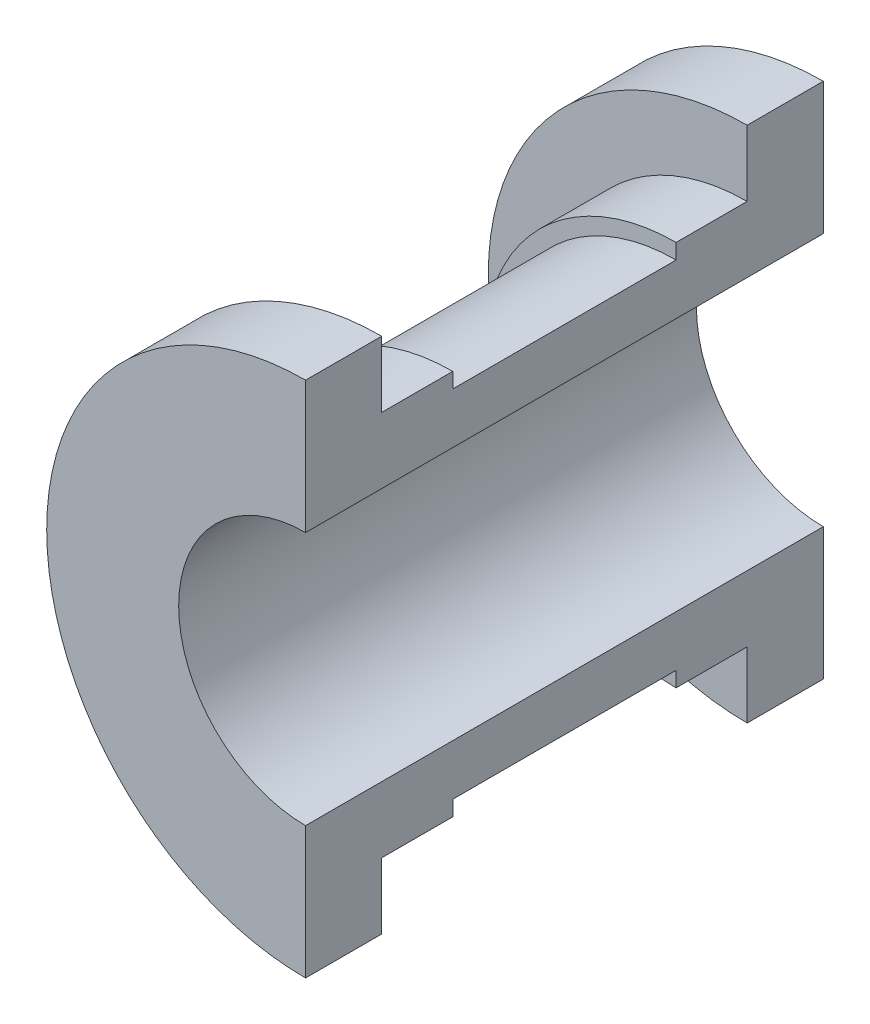
ISO-10303-21;
HEADER;
FILE_DESCRIPTION(('STEP AP214'),'2;1');
FILE_NAME('part.step','',(''),(''),'','','');
FILE_SCHEMA(('AUTOMOTIVE_DESIGN { 1 0 10303 214 1 1 1 1 }'));
ENDSEC;
DATA;
#1=APPLICATION_CONTEXT('core data for automotive mechanical design processes');
#2=APPLICATION_PROTOCOL_DEFINITION('international standard','automotive_design',2000,#1);
#3=PRODUCT_CONTEXT('',#1,'mechanical');
#4=PRODUCT('Part','Part','',(#3));
#5=PRODUCT_RELATED_PRODUCT_CATEGORY('part','',(#4));
#6=PRODUCT_DEFINITION_FORMATION('','',#4);
#7=PRODUCT_DEFINITION_CONTEXT('part definition',#1,'design');
#8=PRODUCT_DEFINITION('design','',#6,#7);
#9=PRODUCT_DEFINITION_SHAPE('','',#8);
#10=(LENGTH_UNIT() NAMED_UNIT(*) SI_UNIT(.MILLI.,.METRE.));
#11=(NAMED_UNIT(*) PLANE_ANGLE_UNIT() SI_UNIT($,.RADIAN.));
#12=(NAMED_UNIT(*) SI_UNIT($,.STERADIAN.) SOLID_ANGLE_UNIT());
#13=UNCERTAINTY_MEASURE_WITH_UNIT(LENGTH_MEASURE(1.E-05),#10,'distance_accuracy_value','');
#14=(GEOMETRIC_REPRESENTATION_CONTEXT(3) GLOBAL_UNCERTAINTY_ASSIGNED_CONTEXT((#13)) GLOBAL_UNIT_ASSIGNED_CONTEXT((#10,
#11,#12)) REPRESENTATION_CONTEXT('',''));
#15=CARTESIAN_POINT('',(0.,0.,0.));
#16=DIRECTION('',(0.,0.,1.));
#17=DIRECTION('',(1.,0.,0.));
#18=AXIS2_PLACEMENT_3D('',#15,#16,#17);
#19=CARTESIAN_POINT('',(-23.5,0.,25.5));
#20=DIRECTION('',(1.,0.,0.));
#21=DIRECTION('',(0.,0.,-1.));
#22=AXIS2_PLACEMENT_3D('',#19,#20,#21);
#23=CYLINDRICAL_SURFACE('',#22,3.);
#24=CARTESIAN_POINT('',(-23.5,0.,25.5));
#25=DIRECTION('',(1.,0.,0.));
#26=DIRECTION('',(0.,0.,-1.));
#27=AXIS2_PLACEMENT_3D('',#24,#25,#26);
#28=CIRCLE('',#27,3.);
#29=CARTESIAN_POINT('',(-23.5,0.,22.5));
#30=VERTEX_POINT('',#29);
#31=EDGE_CURVE('E11',#30,#30,#28,.T.);
#32=ORIENTED_EDGE('',*,*,#31,.T.);
#33=EDGE_LOOP('',(#32));
#34=FACE_BOUND('',#33,.T.);
#35=CARTESIAN_POINT('',(-17.5,0.,25.5));
#36=DIRECTION('',(1.,0.,0.));
#37=DIRECTION('',(0.,0.,-1.));
#38=AXIS2_PLACEMENT_3D('',#35,#36,#37);
#39=CIRCLE('',#38,3.);
#40=CARTESIAN_POINT('',(-17.5,0.,22.5));
#41=VERTEX_POINT('',#40);
#42=EDGE_CURVE('E44',#41,#41,#39,.T.);
#43=ORIENTED_EDGE('',*,*,#42,.F.);
#44=EDGE_LOOP('',(#43));
#45=FACE_BOUND('',#44,.T.);
#46=ADVANCED_FACE('F41',(#34,#45),#23,.T.);
#47=CARTESIAN_POINT('',(-23.5,0.,25.5));
#48=DIRECTION('',(1.,0.,0.));
#49=DIRECTION('',(0.,0.,-1.));
#50=AXIS2_PLACEMENT_3D('',#47,#48,#49);
#51=PLANE('',#50);
#52=ORIENTED_EDGE('',*,*,#31,.F.);
#53=EDGE_LOOP('',(#52));
#54=FACE_BOUND('',#53,.T.);
#55=ADVANCED_FACE('F56',(#54),#51,.F.);
#56=CARTESIAN_POINT('',(-17.5,0.,25.5));
#57=DIRECTION('',(1.,0.,0.));
#58=DIRECTION('',(0.,0.,-1.));
#59=AXIS2_PLACEMENT_3D('',#56,#57,#58);
#60=PLANE('',#59);
#61=ORIENTED_EDGE('',*,*,#42,.T.);
#62=EDGE_LOOP('',(#61));
#63=FACE_BOUND('',#62,.T.);
#64=ADVANCED_FACE('F53',(#63),#60,.T.);
#65=CLOSED_SHELL('',(#46,#55,#64));
#66=MANIFOLD_SOLID_BREP('B2',#65);
#67=CARTESIAN_POINT('',(0.,-25.5,0.));
#68=DIRECTION('',(0.,0.,-1.));
#69=DIRECTION('',(-1.,0.,0.));
#70=AXIS2_PLACEMENT_3D('',#67,#68,#69);
#71=PLANE('',#70);
#72=CARTESIAN_POINT('',(0.,0.,0.));
#73=DIRECTION('',(0.,0.,-1.));
#74=DIRECTION('',(-1.,0.,0.));
#75=AXIS2_PLACEMENT_3D('',#72,#73,#74);
#76=CIRCLE('',#75,12.5);
#77=CARTESIAN_POINT('',(0.,-12.5,0.));
#78=VERTEX_POINT('',#77);
#79=CARTESIAN_POINT('',(0.,12.5,0.));
#80=VERTEX_POINT('',#79);
#81=EDGE_CURVE('E39',#78,#80,#76,.T.);
#82=ORIENTED_EDGE('',*,*,#81,.F.);
#83=DIRECTION('',(0.,-1.,0.));
#84=VECTOR('',#83,1.);
#85=CARTESIAN_POINT('',(0.,-25.5,0.));
#86=LINE('',#85,#84);
#87=CARTESIAN_POINT('',(0.,-25.5,0.));
#88=VERTEX_POINT('',#87);
#89=EDGE_CURVE('E171',#78,#88,#86,.T.);
#90=ORIENTED_EDGE('',*,*,#89,.T.);
#91=CARTESIAN_POINT('',(0.,0.,0.));
#92=DIRECTION('',(0.,0.,-1.));
#93=DIRECTION('',(-1.,0.,0.));
#94=AXIS2_PLACEMENT_3D('',#91,#92,#93);
#95=CIRCLE('',#94,25.5);
#96=CARTESIAN_POINT('',(0.,25.5,0.));
#97=VERTEX_POINT('',#96);
#98=EDGE_CURVE('E166',#88,#97,#95,.T.);
#99=ORIENTED_EDGE('',*,*,#98,.T.);
#100=DIRECTION('',(0.,1.,0.));
#101=VECTOR('',#100,1.);
#102=CARTESIAN_POINT('',(0.,25.5,0.));
#103=LINE('',#102,#101);
#104=EDGE_CURVE('E169',#80,#97,#103,.T.);
#105=ORIENTED_EDGE('',*,*,#104,.F.);
#106=EDGE_LOOP('',(#82,#90,#99,#105));
#107=FACE_BOUND('',#106,.T.);
#108=ADVANCED_FACE('F82',(#107),#71,.T.);
#109=CARTESIAN_POINT('',(0.,0.,-45.6568957060864));
#110=DIRECTION('',(0.,0.,-1.));
#111=DIRECTION('',(-1.,0.,0.));
#112=AXIS2_PLACEMENT_3D('',#109,#110,#111);
#113=CYLINDRICAL_SURFACE('',#112,12.5);
#114=CARTESIAN_POINT('',(0.,0.,51.));
#115=DIRECTION('',(0.,0.,-1.));
#116=DIRECTION('',(-1.,0.,0.));
#117=AXIS2_PLACEMENT_3D('',#114,#115,#116);
#118=CIRCLE('',#117,12.5);
#119=CARTESIAN_POINT('',(0.,-12.5,51.));
#120=VERTEX_POINT('',#119);
#121=CARTESIAN_POINT('',(0.,12.5,51.));
#122=VERTEX_POINT('',#121);
#123=EDGE_CURVE('E90',#120,#122,#118,.T.);
#124=ORIENTED_EDGE('',*,*,#123,.F.);
#125=DIRECTION('',(0.,0.,-1.));
#126=VECTOR('',#125,1.);
#127=CARTESIAN_POINT('',(0.,-12.5,0.));
#128=LINE('',#127,#126);
#129=EDGE_CURVE('E176',#120,#78,#128,.T.);
#130=ORIENTED_EDGE('',*,*,#129,.T.);
#131=ORIENTED_EDGE('',*,*,#81,.T.);
#132=DIRECTION('',(0.,0.,-1.));
#133=VECTOR('',#132,1.);
#134=CARTESIAN_POINT('',(0.,12.5,0.));
#135=LINE('',#134,#133);
#136=EDGE_CURVE('E189',#122,#80,#135,.T.);
#137=ORIENTED_EDGE('',*,*,#136,.F.);
#138=EDGE_LOOP('',(#124,#130,#131,#137));
#139=FACE_BOUND('',#138,.T.);
#140=ADVANCED_FACE('F84',(#139),#113,.F.);
#141=CARTESIAN_POINT('',(0.,-12.5,51.));
#142=DIRECTION('',(0.,0.,1.));
#143=DIRECTION('',(1.,0.,0.));
#144=AXIS2_PLACEMENT_3D('',#141,#142,#143);
#145=PLANE('',#144);
#146=CARTESIAN_POINT('',(0.,0.,51.));
#147=DIRECTION('',(0.,0.,-1.));
#148=DIRECTION('',(-1.,0.,0.));
#149=AXIS2_PLACEMENT_3D('',#146,#147,#148);
#150=CIRCLE('',#149,25.5);
#151=CARTESIAN_POINT('',(0.,-25.5,51.));
#152=VERTEX_POINT('',#151);
#153=CARTESIAN_POINT('',(0.,25.5,51.));
#154=VERTEX_POINT('',#153);
#155=EDGE_CURVE('E262',#152,#154,#150,.T.);
#156=ORIENTED_EDGE('',*,*,#155,.F.);
#157=DIRECTION('',(0.,1.,0.));
#158=VECTOR('',#157,1.);
#159=CARTESIAN_POINT('',(0.,-12.5,51.));
#160=LINE('',#159,#158);
#161=EDGE_CURVE('E244',#152,#120,#160,.T.);
#162=ORIENTED_EDGE('',*,*,#161,.T.);
#163=ORIENTED_EDGE('',*,*,#123,.T.);
#164=DIRECTION('',(0.,-1.,0.));
#165=VECTOR('',#164,1.);
#166=CARTESIAN_POINT('',(0.,12.5,51.));
#167=LINE('',#166,#165);
#168=EDGE_CURVE('E214',#154,#122,#167,.T.);
#169=ORIENTED_EDGE('',*,*,#168,.F.);
#170=EDGE_LOOP('',(#156,#162,#163,#169));
#171=FACE_BOUND('',#170,.T.);
#172=ADVANCED_FACE('F265',(#171),#145,.T.);
#173=CARTESIAN_POINT('',(0.,0.,-45.6568957060864));
#174=DIRECTION('',(0.,0.,-1.));
#175=DIRECTION('',(-1.,0.,0.));
#176=AXIS2_PLACEMENT_3D('',#173,#174,#175);
#177=CYLINDRICAL_SURFACE('',#176,25.5);
#178=CARTESIAN_POINT('',(0.,0.,43.5));
#179=DIRECTION('',(0.,0.,-1.));
#180=DIRECTION('',(-1.,0.,0.));
#181=AXIS2_PLACEMENT_3D('',#178,#179,#180);
#182=CIRCLE('',#181,25.5);
#183=CARTESIAN_POINT('',(0.,-25.5,43.5));
#184=VERTEX_POINT('',#183);
#185=CARTESIAN_POINT('',(0.,25.5,43.5));
#186=VERTEX_POINT('',#185);
#187=EDGE_CURVE('E260',#184,#186,#182,.T.);
#188=ORIENTED_EDGE('',*,*,#187,.F.);
#189=DIRECTION('',(0.,0.,1.));
#190=VECTOR('',#189,1.);
#191=CARTESIAN_POINT('',(0.,-25.5,51.));
#192=LINE('',#191,#190);
#193=EDGE_CURVE('E241',#184,#152,#192,.T.);
#194=ORIENTED_EDGE('',*,*,#193,.T.);
#195=ORIENTED_EDGE('',*,*,#155,.T.);
#196=DIRECTION('',(0.,0.,1.));
#197=VECTOR('',#196,1.);
#198=CARTESIAN_POINT('',(0.,25.5,51.));
#199=LINE('',#198,#197);
#200=EDGE_CURVE('E211',#186,#154,#199,.T.);
#201=ORIENTED_EDGE('',*,*,#200,.F.);
#202=EDGE_LOOP('',(#188,#194,#195,#201));
#203=FACE_BOUND('',#202,.T.);
#204=ADVANCED_FACE('F300',(#203),#177,.T.);
#205=CARTESIAN_POINT('',(0.,-25.5,43.5));
#206=DIRECTION('',(0.,0.,-1.));
#207=DIRECTION('',(-1.,0.,0.));
#208=AXIS2_PLACEMENT_3D('',#205,#206,#207);
#209=PLANE('',#208);
#210=CARTESIAN_POINT('',(0.,0.,43.5));
#211=DIRECTION('',(0.,0.,-1.));
#212=DIRECTION('',(-1.,0.,0.));
#213=AXIS2_PLACEMENT_3D('',#210,#211,#212);
#214=CIRCLE('',#213,19.);
#215=CARTESIAN_POINT('',(0.,-19.,43.5));
#216=VERTEX_POINT('',#215);
#217=CARTESIAN_POINT('',(0.,19.,43.5));
#218=VERTEX_POINT('',#217);
#219=EDGE_CURVE('E258',#216,#218,#214,.T.);
#220=ORIENTED_EDGE('',*,*,#219,.F.);
#221=DIRECTION('',(0.,-1.,0.));
#222=VECTOR('',#221,1.);
#223=CARTESIAN_POINT('',(0.,-25.5,43.5));
#224=LINE('',#223,#222);
#225=EDGE_CURVE('E238',#216,#184,#224,.T.);
#226=ORIENTED_EDGE('',*,*,#225,.T.);
#227=ORIENTED_EDGE('',*,*,#187,.T.);
#228=DIRECTION('',(0.,1.,0.));
#229=VECTOR('',#228,1.);
#230=CARTESIAN_POINT('',(0.,25.5,43.5));
#231=LINE('',#230,#229);
#232=EDGE_CURVE('E208',#218,#186,#231,.T.);
#233=ORIENTED_EDGE('',*,*,#232,.F.);
#234=EDGE_LOOP('',(#220,#226,#227,#233));
#235=FACE_BOUND('',#234,.T.);
#236=ADVANCED_FACE('F297',(#235),#209,.T.);
#237=CARTESIAN_POINT('',(0.,0.,-45.6568957060864));
#238=DIRECTION('',(0.,0.,-1.));
#239=DIRECTION('',(-1.,0.,0.));
#240=AXIS2_PLACEMENT_3D('',#237,#238,#239);
#241=CYLINDRICAL_SURFACE('',#240,19.);
#242=CARTESIAN_POINT('',(0.,0.,36.5));
#243=DIRECTION('',(0.,0.,-1.));
#244=DIRECTION('',(-1.,0.,0.));
#245=AXIS2_PLACEMENT_3D('',#242,#243,#244);
#246=CIRCLE('',#245,19.);
#247=CARTESIAN_POINT('',(0.,-19.,36.5));
#248=VERTEX_POINT('',#247);
#249=CARTESIAN_POINT('',(0.,19.,36.5));
#250=VERTEX_POINT('',#249);
#251=EDGE_CURVE('E256',#248,#250,#246,.T.);
#252=ORIENTED_EDGE('',*,*,#251,.F.);
#253=DIRECTION('',(0.,0.,1.));
#254=VECTOR('',#253,1.);
#255=CARTESIAN_POINT('',(0.,-19.,43.5));
#256=LINE('',#255,#254);
#257=EDGE_CURVE('E235',#248,#216,#256,.T.);
#258=ORIENTED_EDGE('',*,*,#257,.T.);
#259=ORIENTED_EDGE('',*,*,#219,.T.);
#260=DIRECTION('',(0.,0.,1.));
#261=VECTOR('',#260,1.);
#262=CARTESIAN_POINT('',(0.,19.,43.5));
#263=LINE('',#262,#261);
#264=EDGE_CURVE('E205',#250,#218,#263,.T.);
#265=ORIENTED_EDGE('',*,*,#264,.F.);
#266=EDGE_LOOP('',(#252,#258,#259,#265));
#267=FACE_BOUND('',#266,.T.);
#268=ADVANCED_FACE('F294',(#267),#241,.T.);
#269=CARTESIAN_POINT('',(0.,-19.,36.5));
#270=DIRECTION('',(0.,0.,-1.));
#271=DIRECTION('',(-1.,0.,0.));
#272=AXIS2_PLACEMENT_3D('',#269,#270,#271);
#273=PLANE('',#272);
#274=CARTESIAN_POINT('',(0.,0.,36.5));
#275=DIRECTION('',(0.,0.,-1.));
#276=DIRECTION('',(-1.,0.,0.));
#277=AXIS2_PLACEMENT_3D('',#274,#275,#276);
#278=CIRCLE('',#277,17.5);
#279=CARTESIAN_POINT('',(0.,-17.5,36.5));
#280=VERTEX_POINT('',#279);
#281=CARTESIAN_POINT('',(0.,17.5,36.5));
#282=VERTEX_POINT('',#281);
#283=EDGE_CURVE('E254',#280,#282,#278,.T.);
#284=ORIENTED_EDGE('',*,*,#283,.F.);
#285=DIRECTION('',(0.,-1.,0.));
#286=VECTOR('',#285,1.);
#287=CARTESIAN_POINT('',(0.,-19.,36.5));
#288=LINE('',#287,#286);
#289=EDGE_CURVE('E232',#280,#248,#288,.T.);
#290=ORIENTED_EDGE('',*,*,#289,.T.);
#291=ORIENTED_EDGE('',*,*,#251,.T.);
#292=DIRECTION('',(0.,1.,0.));
#293=VECTOR('',#292,1.);
#294=CARTESIAN_POINT('',(0.,19.,36.5));
#295=LINE('',#294,#293);
#296=EDGE_CURVE('E202',#282,#250,#295,.T.);
#297=ORIENTED_EDGE('',*,*,#296,.F.);
#298=EDGE_LOOP('',(#284,#290,#291,#297));
#299=FACE_BOUND('',#298,.T.);
#300=ADVANCED_FACE('F289',(#299),#273,.T.);
#301=CARTESIAN_POINT('',(0.,0.,-45.6568957060864));
#302=DIRECTION('',(0.,0.,-1.));
#303=DIRECTION('',(-1.,0.,0.));
#304=AXIS2_PLACEMENT_3D('',#301,#302,#303);
#305=CYLINDRICAL_SURFACE('',#304,17.5);
#306=CARTESIAN_POINT('',(0.,0.,14.5));
#307=DIRECTION('',(0.,0.,-1.));
#308=DIRECTION('',(-1.,0.,0.));
#309=AXIS2_PLACEMENT_3D('',#306,#307,#308);
#310=CIRCLE('',#309,17.5);
#311=CARTESIAN_POINT('',(0.,-17.5,14.5));
#312=VERTEX_POINT('',#311);
#313=CARTESIAN_POINT('',(0.,17.5,14.5));
#314=VERTEX_POINT('',#313);
#315=EDGE_CURVE('E252',#312,#314,#310,.T.);
#316=ORIENTED_EDGE('',*,*,#315,.F.);
#317=DIRECTION('',(0.,0.,1.));
#318=VECTOR('',#317,1.);
#319=CARTESIAN_POINT('',(0.,-17.5,36.5));
#320=LINE('',#319,#318);
#321=EDGE_CURVE('E229',#312,#280,#320,.T.);
#322=ORIENTED_EDGE('',*,*,#321,.T.);
#323=ORIENTED_EDGE('',*,*,#283,.T.);
#324=DIRECTION('',(0.,0.,1.));
#325=VECTOR('',#324,1.);
#326=CARTESIAN_POINT('',(0.,17.5,36.5));
#327=LINE('',#326,#325);
#328=EDGE_CURVE('E199',#314,#282,#327,.T.);
#329=ORIENTED_EDGE('',*,*,#328,.F.);
#330=EDGE_LOOP('',(#316,#322,#323,#329));
#331=FACE_BOUND('',#330,.T.);
#332=ADVANCED_FACE('F286',(#331),#305,.T.);
#333=CARTESIAN_POINT('',(0.,-17.5,14.5));
#334=DIRECTION('',(0.,0.,1.));
#335=DIRECTION('',(1.,0.,0.));
#336=AXIS2_PLACEMENT_3D('',#333,#334,#335);
#337=PLANE('',#336);
#338=CARTESIAN_POINT('',(0.,0.,14.5));
#339=DIRECTION('',(0.,0.,-1.));
#340=DIRECTION('',(-1.,0.,0.));
#341=AXIS2_PLACEMENT_3D('',#338,#339,#340);
#342=CIRCLE('',#341,19.);
#343=CARTESIAN_POINT('',(0.,-19.,14.5));
#344=VERTEX_POINT('',#343);
#345=CARTESIAN_POINT('',(0.,19.,14.5));
#346=VERTEX_POINT('',#345);
#347=EDGE_CURVE('E250',#344,#346,#342,.T.);
#348=ORIENTED_EDGE('',*,*,#347,.F.);
#349=DIRECTION('',(0.,1.,0.));
#350=VECTOR('',#349,1.);
#351=CARTESIAN_POINT('',(0.,-17.5,14.5));
#352=LINE('',#351,#350);
#353=EDGE_CURVE('E226',#344,#312,#352,.T.);
#354=ORIENTED_EDGE('',*,*,#353,.T.);
#355=ORIENTED_EDGE('',*,*,#315,.T.);
#356=DIRECTION('',(0.,-1.,0.));
#357=VECTOR('',#356,1.);
#358=CARTESIAN_POINT('',(0.,17.5,14.5));
#359=LINE('',#358,#357);
#360=EDGE_CURVE('E196',#346,#314,#359,.T.);
#361=ORIENTED_EDGE('',*,*,#360,.F.);
#362=EDGE_LOOP('',(#348,#354,#355,#361));
#363=FACE_BOUND('',#362,.T.);
#364=ADVANCED_FACE('F281',(#363),#337,.T.);
#365=CARTESIAN_POINT('',(0.,0.,-45.6568957060864));
#366=DIRECTION('',(0.,0.,-1.));
#367=DIRECTION('',(-1.,0.,0.));
#368=AXIS2_PLACEMENT_3D('',#365,#366,#367);
#369=CYLINDRICAL_SURFACE('',#368,19.);
#370=CARTESIAN_POINT('',(0.,0.,7.5));
#371=DIRECTION('',(0.,0.,-1.));
#372=DIRECTION('',(-1.,0.,0.));
#373=AXIS2_PLACEMENT_3D('',#370,#371,#372);
#374=CIRCLE('',#373,19.);
#375=CARTESIAN_POINT('',(0.,-19.,7.5));
#376=VERTEX_POINT('',#375);
#377=CARTESIAN_POINT('',(0.,19.,7.5));
#378=VERTEX_POINT('',#377);
#379=EDGE_CURVE('E248',#376,#378,#374,.T.);
#380=ORIENTED_EDGE('',*,*,#379,.F.);
#381=DIRECTION('',(0.,0.,1.));
#382=VECTOR('',#381,1.);
#383=CARTESIAN_POINT('',(0.,-19.,14.5));
#384=LINE('',#383,#382);
#385=EDGE_CURVE('E223',#376,#344,#384,.T.);
#386=ORIENTED_EDGE('',*,*,#385,.T.);
#387=ORIENTED_EDGE('',*,*,#347,.T.);
#388=DIRECTION('',(0.,0.,1.));
#389=VECTOR('',#388,1.);
#390=CARTESIAN_POINT('',(0.,19.,14.5));
#391=LINE('',#390,#389);
#392=EDGE_CURVE('E193',#378,#346,#391,.T.);
#393=ORIENTED_EDGE('',*,*,#392,.F.);
#394=EDGE_LOOP('',(#380,#386,#387,#393));
#395=FACE_BOUND('',#394,.T.);
#396=ADVANCED_FACE('F279',(#395),#369,.T.);
#397=CARTESIAN_POINT('',(0.,-19.,7.5));
#398=DIRECTION('',(0.,0.,1.));
#399=DIRECTION('',(1.,0.,0.));
#400=AXIS2_PLACEMENT_3D('',#397,#398,#399);
#401=PLANE('',#400);
#402=CARTESIAN_POINT('',(0.,0.,7.5));
#403=DIRECTION('',(0.,0.,-1.));
#404=DIRECTION('',(-1.,0.,0.));
#405=AXIS2_PLACEMENT_3D('',#402,#403,#404);
#406=CIRCLE('',#405,25.5);
#407=CARTESIAN_POINT('',(0.,-25.5,7.5));
#408=VERTEX_POINT('',#407);
#409=CARTESIAN_POINT('',(0.,25.5,7.5));
#410=VERTEX_POINT('',#409);
#411=EDGE_CURVE('E175',#408,#410,#406,.T.);
#412=ORIENTED_EDGE('',*,*,#411,.F.);
#413=DIRECTION('',(0.,1.,0.));
#414=VECTOR('',#413,1.);
#415=CARTESIAN_POINT('',(0.,-19.,7.5));
#416=LINE('',#415,#414);
#417=EDGE_CURVE('E220',#408,#376,#416,.T.);
#418=ORIENTED_EDGE('',*,*,#417,.T.);
#419=ORIENTED_EDGE('',*,*,#379,.T.);
#420=DIRECTION('',(0.,-1.,0.));
#421=VECTOR('',#420,1.);
#422=CARTESIAN_POINT('',(0.,19.,7.5));
#423=LINE('',#422,#421);
#424=EDGE_CURVE('E184',#410,#378,#423,.T.);
#425=ORIENTED_EDGE('',*,*,#424,.F.);
#426=EDGE_LOOP('',(#412,#418,#419,#425));
#427=FACE_BOUND('',#426,.T.);
#428=ADVANCED_FACE('F275',(#427),#401,.T.);
#429=CARTESIAN_POINT('',(0.,0.,-45.6568957060864));
#430=DIRECTION('',(0.,0.,-1.));
#431=DIRECTION('',(-1.,0.,0.));
#432=AXIS2_PLACEMENT_3D('',#429,#430,#431);
#433=CYLINDRICAL_SURFACE('',#432,25.5);
#434=DIRECTION('',(0.,0.,1.));
#435=VECTOR('',#434,1.);
#436=CARTESIAN_POINT('',(0.,-25.5,7.5));
#437=LINE('',#436,#435);
#438=EDGE_CURVE('E218',#88,#408,#437,.T.);
#439=ORIENTED_EDGE('',*,*,#438,.T.);
#440=ORIENTED_EDGE('',*,*,#411,.T.);
#441=DIRECTION('',(0.,0.,1.));
#442=VECTOR('',#441,1.);
#443=CARTESIAN_POINT('',(0.,25.5,7.5));
#444=LINE('',#443,#442);
#445=EDGE_CURVE('E179',#97,#410,#444,.T.);
#446=ORIENTED_EDGE('',*,*,#445,.F.);
#447=ORIENTED_EDGE('',*,*,#98,.F.);
#448=EDGE_LOOP('',(#439,#440,#446,#447));
#449=FACE_BOUND('',#448,.T.);
#450=ADVANCED_FACE('F180',(#449),#433,.T.);
#451=CARTESIAN_POINT('',(0.,0.,0.));
#452=DIRECTION('',(1.,0.,0.));
#453=DIRECTION('',(0.,0.,-1.));
#454=AXIS2_PLACEMENT_3D('',#451,#452,#453);
#455=PLANE('',#454);
#456=ORIENTED_EDGE('',*,*,#89,.F.);
#457=ORIENTED_EDGE('',*,*,#129,.F.);
#458=ORIENTED_EDGE('',*,*,#161,.F.);
#459=ORIENTED_EDGE('',*,*,#193,.F.);
#460=ORIENTED_EDGE('',*,*,#225,.F.);
#461=ORIENTED_EDGE('',*,*,#257,.F.);
#462=ORIENTED_EDGE('',*,*,#289,.F.);
#463=ORIENTED_EDGE('',*,*,#321,.F.);
#464=ORIENTED_EDGE('',*,*,#353,.F.);
#465=ORIENTED_EDGE('',*,*,#385,.F.);
#466=ORIENTED_EDGE('',*,*,#417,.F.);
#467=ORIENTED_EDGE('',*,*,#438,.F.);
#468=EDGE_LOOP('',(#456,#457,#458,#459,#460,#461,#462,#463,#464,#465,#466,#467));
#469=FACE_BOUND('',#468,.T.);
#470=ADVANCED_FACE('F270',(#469),#455,.T.);
#471=CARTESIAN_POINT('',(0.,0.,0.));
#472=DIRECTION('',(-1.,0.,0.));
#473=DIRECTION('',(0.,0.,-1.));
#474=AXIS2_PLACEMENT_3D('',#471,#472,#473);
#475=PLANE('',#474);
#476=ORIENTED_EDGE('',*,*,#104,.T.);
#477=ORIENTED_EDGE('',*,*,#445,.T.);
#478=ORIENTED_EDGE('',*,*,#424,.T.);
#479=ORIENTED_EDGE('',*,*,#392,.T.);
#480=ORIENTED_EDGE('',*,*,#360,.T.);
#481=ORIENTED_EDGE('',*,*,#328,.T.);
#482=ORIENTED_EDGE('',*,*,#296,.T.);
#483=ORIENTED_EDGE('',*,*,#264,.T.);
#484=ORIENTED_EDGE('',*,*,#232,.T.);
#485=ORIENTED_EDGE('',*,*,#200,.T.);
#486=ORIENTED_EDGE('',*,*,#168,.T.);
#487=ORIENTED_EDGE('',*,*,#136,.T.);
#488=EDGE_LOOP('',(#476,#477,#478,#479,#480,#481,#482,#483,#484,#485,#486,#487));
#489=FACE_BOUND('',#488,.T.);
#490=ADVANCED_FACE('F187',(#489),#475,.F.);
#491=CLOSED_SHELL('',(#108,#140,#172,#204,#236,#268,#300,#332,#364,#396,#428,#450,#470,#490));
#492=MANIFOLD_SOLID_BREP('B6',#491);
#493=ADVANCED_BREP_SHAPE_REPRESENTATION('',(#18,#66,#492),#14);
#494=SHAPE_DEFINITION_REPRESENTATION(#9,#493);
ENDSEC;
END-ISO-10303-21;
